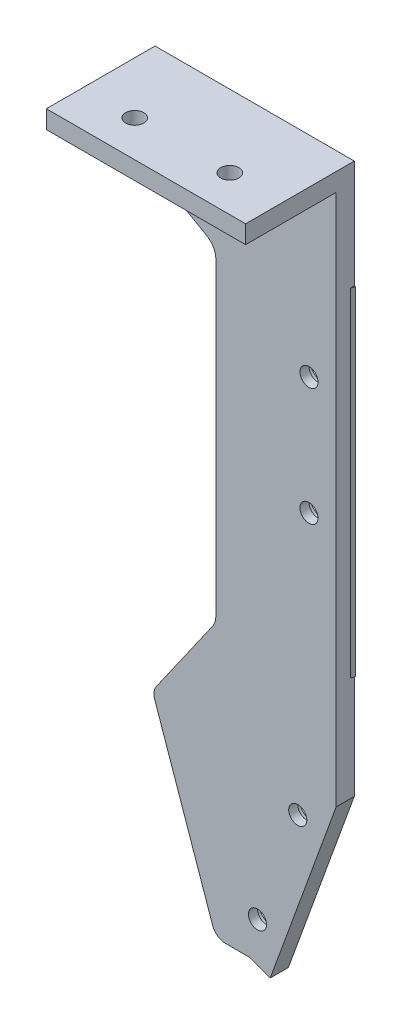
ISO-10303-21;
HEADER;
FILE_DESCRIPTION(('STEP AP214'),'2;1');
FILE_NAME('part.step','',(''),(''),'','','');
FILE_SCHEMA(('AUTOMOTIVE_DESIGN { 1 0 10303 214 1 1 1 1 }'));
ENDSEC;
DATA;
#1=APPLICATION_CONTEXT('core data for automotive mechanical design processes');
#2=APPLICATION_PROTOCOL_DEFINITION('international standard','automotive_design',2000,#1);
#3=PRODUCT_CONTEXT('',#1,'mechanical');
#4=PRODUCT('Part','Part','',(#3));
#5=PRODUCT_RELATED_PRODUCT_CATEGORY('part','',(#4));
#6=PRODUCT_DEFINITION_FORMATION('','',#4);
#7=PRODUCT_DEFINITION_CONTEXT('part definition',#1,'design');
#8=PRODUCT_DEFINITION('design','',#6,#7);
#9=PRODUCT_DEFINITION_SHAPE('','',#8);
#10=(LENGTH_UNIT() NAMED_UNIT(*) SI_UNIT(.MILLI.,.METRE.));
#11=(NAMED_UNIT(*) PLANE_ANGLE_UNIT() SI_UNIT($,.RADIAN.));
#12=(NAMED_UNIT(*) SI_UNIT($,.STERADIAN.) SOLID_ANGLE_UNIT());
#13=UNCERTAINTY_MEASURE_WITH_UNIT(LENGTH_MEASURE(1.E-05),#10,'distance_accuracy_value','');
#14=(GEOMETRIC_REPRESENTATION_CONTEXT(3) GLOBAL_UNCERTAINTY_ASSIGNED_CONTEXT((#13)) GLOBAL_UNIT_ASSIGNED_CONTEXT((#10,
#11,#12)) REPRESENTATION_CONTEXT('',''));
#15=CARTESIAN_POINT('',(0.,0.,0.));
#16=DIRECTION('',(0.,0.,1.));
#17=DIRECTION('',(1.,0.,0.));
#18=AXIS2_PLACEMENT_3D('',#15,#16,#17);
#19=CARTESIAN_POINT('',(92.2895532458189,-51.5135083268963,13.5));
#20=DIRECTION('',(0.,0.,1.));
#21=DIRECTION('',(1.,0.,0.));
#22=AXIS2_PLACEMENT_3D('',#19,#20,#21);
#23=CYLINDRICAL_SURFACE('',#22,0.999999999999998);
#24=CARTESIAN_POINT('',(92.2895532458189,-51.5135083268963,23.5));
#25=DIRECTION('',(0.,0.,1.));
#26=DIRECTION('',(1.,0.,0.));
#27=AXIS2_PLACEMENT_3D('',#24,#25,#26);
#28=CIRCLE('',#27,0.999999999999998);
#29=CARTESIAN_POINT('',(93.2895532458189,-51.5135083268963,23.5));
#30=VERTEX_POINT('',#29);
#31=EDGE_CURVE('E360',#30,#30,#28,.T.);
#32=ORIENTED_EDGE('',*,*,#31,.T.);
#33=EDGE_LOOP('',(#32));
#34=FACE_BOUND('',#33,.T.);
#35=CARTESIAN_POINT('',(92.2895532458189,-51.5135083268963,22.5));
#36=DIRECTION('',(0.,0.,-1.));
#37=DIRECTION('',(-1.,0.,0.));
#38=AXIS2_PLACEMENT_3D('',#35,#36,#37);
#39=CIRCLE('',#38,0.999999999999998);
#40=CARTESIAN_POINT('',(91.2895532458189,-51.5135083268963,22.5));
#41=VERTEX_POINT('',#40);
#42=EDGE_CURVE('E40',#41,#41,#39,.F.);
#43=ORIENTED_EDGE('',*,*,#42,.F.);
#44=EDGE_LOOP('',(#43));
#45=FACE_BOUND('',#44,.T.);
#46=ADVANCED_FACE('F36',(#34,#45),#23,.F.);
#47=CARTESIAN_POINT('',(91.0464555518717,-94.0197311334143,13.5));
#48=DIRECTION('',(0.,0.,1.));
#49=DIRECTION('',(1.,0.,0.));
#50=AXIS2_PLACEMENT_3D('',#47,#48,#49);
#51=CYLINDRICAL_SURFACE('',#50,0.999999999999998);
#52=CARTESIAN_POINT('',(91.0464555518717,-94.0197311334143,23.5));
#53=DIRECTION('',(0.,0.,1.));
#54=DIRECTION('',(1.,0.,0.));
#55=AXIS2_PLACEMENT_3D('',#52,#53,#54);
#56=CIRCLE('',#55,0.999999999999998);
#57=CARTESIAN_POINT('',(92.0464555518717,-94.0197311334143,23.5));
#58=VERTEX_POINT('',#57);
#59=EDGE_CURVE('E336',#58,#58,#56,.T.);
#60=ORIENTED_EDGE('',*,*,#59,.T.);
#61=EDGE_LOOP('',(#60));
#62=FACE_BOUND('',#61,.T.);
#63=CARTESIAN_POINT('',(91.0464555518717,-94.0197311334143,22.5));
#64=DIRECTION('',(0.,0.,-1.));
#65=DIRECTION('',(-1.,0.,0.));
#66=AXIS2_PLACEMENT_3D('',#63,#64,#65);
#67=CIRCLE('',#66,0.999999999999998);
#68=CARTESIAN_POINT('',(90.0464555518717,-94.0197311334143,22.5));
#69=VERTEX_POINT('',#68);
#70=EDGE_CURVE('E340',#69,#69,#67,.F.);
#71=ORIENTED_EDGE('',*,*,#70,.F.);
#72=EDGE_LOOP('',(#71));
#73=FACE_BOUND('',#72,.T.);
#74=ADVANCED_FACE('F461',(#62,#73),#51,.F.);
#75=CARTESIAN_POINT('',(92.2895532458189,-64.5135083268963,13.5));
#76=DIRECTION('',(0.,0.,1.));
#77=DIRECTION('',(1.,0.,0.));
#78=AXIS2_PLACEMENT_3D('',#75,#76,#77);
#79=CYLINDRICAL_SURFACE('',#78,0.999999999999998);
#80=CARTESIAN_POINT('',(92.2895532458189,-64.5135083268963,23.5));
#81=DIRECTION('',(0.,0.,1.));
#82=DIRECTION('',(1.,0.,0.));
#83=AXIS2_PLACEMENT_3D('',#80,#81,#82);
#84=CIRCLE('',#83,0.999999999999998);
#85=CARTESIAN_POINT('',(93.2895532458189,-64.5135083268963,23.5));
#86=VERTEX_POINT('',#85);
#87=EDGE_CURVE('E357',#86,#86,#84,.T.);
#88=ORIENTED_EDGE('',*,*,#87,.T.);
#89=EDGE_LOOP('',(#88));
#90=FACE_BOUND('',#89,.T.);
#91=CARTESIAN_POINT('',(92.2895532458189,-64.5135083268963,22.5));
#92=DIRECTION('',(0.,0.,-1.));
#93=DIRECTION('',(-1.,0.,0.));
#94=AXIS2_PLACEMENT_3D('',#91,#92,#93);
#95=CIRCLE('',#94,0.999999999999998);
#96=CARTESIAN_POINT('',(91.2895532458189,-64.5135083268963,22.5));
#97=VERTEX_POINT('',#96);
#98=EDGE_CURVE('E338',#97,#97,#95,.F.);
#99=ORIENTED_EDGE('',*,*,#98,.F.);
#100=EDGE_LOOP('',(#99));
#101=FACE_BOUND('',#100,.T.);
#102=ADVANCED_FACE('F468',(#90,#101),#79,.F.);
#103=CARTESIAN_POINT('',(86.6001936886376,-106.235735203631,13.5));
#104=DIRECTION('',(0.,0.,1.));
#105=DIRECTION('',(1.,0.,0.));
#106=AXIS2_PLACEMENT_3D('',#103,#104,#105);
#107=CYLINDRICAL_SURFACE('',#106,0.999999999999998);
#108=CARTESIAN_POINT('',(86.6001936886376,-106.235735203631,23.5));
#109=DIRECTION('',(0.,0.,1.));
#110=DIRECTION('',(1.,0.,0.));
#111=AXIS2_PLACEMENT_3D('',#108,#109,#110);
#112=CIRCLE('',#111,0.999999999999998);
#113=CARTESIAN_POINT('',(87.6001936886376,-106.235735203631,23.5));
#114=VERTEX_POINT('',#113);
#115=EDGE_CURVE('E361',#114,#114,#112,.T.);
#116=ORIENTED_EDGE('',*,*,#115,.T.);
#117=EDGE_LOOP('',(#116));
#118=FACE_BOUND('',#117,.T.);
#119=CARTESIAN_POINT('',(86.6001936886376,-106.235735203631,22.5));
#120=DIRECTION('',(0.,0.,-1.));
#121=DIRECTION('',(-1.,0.,0.));
#122=AXIS2_PLACEMENT_3D('',#119,#120,#121);
#123=CIRCLE('',#122,0.999999999999998);
#124=CARTESIAN_POINT('',(85.6001936886376,-106.235735203631,22.5));
#125=VERTEX_POINT('',#124);
#126=EDGE_CURVE('E333',#125,#125,#123,.F.);
#127=ORIENTED_EDGE('',*,*,#126,.F.);
#128=EDGE_LOOP('',(#127));
#129=FACE_BOUND('',#128,.T.);
#130=ADVANCED_FACE('F492',(#118,#129),#107,.F.);
#131=CARTESIAN_POINT('',(0.,0.,23.5));
#132=DIRECTION('',(0.,0.,-1.));
#133=DIRECTION('',(-1.,0.,0.));
#134=AXIS2_PLACEMENT_3D('',#131,#132,#133);
#135=PLANE('',#134);
#136=ORIENTED_EDGE('',*,*,#87,.F.);
#137=EDGE_LOOP('',(#136));
#138=FACE_BOUND('',#137,.T.);
#139=ORIENTED_EDGE('',*,*,#115,.F.);
#140=EDGE_LOOP('',(#139));
#141=FACE_BOUND('',#140,.T.);
#142=ORIENTED_EDGE('',*,*,#59,.F.);
#143=EDGE_LOOP('',(#142));
#144=FACE_BOUND('',#143,.T.);
#145=ORIENTED_EDGE('',*,*,#31,.F.);
#146=EDGE_LOOP('',(#145));
#147=FACE_BOUND('',#146,.T.);
#148=DIRECTION('',(1.,0.,0.));
#149=VECTOR('',#148,1.);
#150=CARTESIAN_POINT('',(95.2895532458189,-32.3635083268963,23.5));
#151=LINE('',#150,#149);
#152=CARTESIAN_POINT('',(73.2895532458189,-32.3635083268963,23.5));
#153=VERTEX_POINT('',#152);
#154=CARTESIAN_POINT('',(95.2895532458189,-32.3635083268963,23.5));
#155=VERTEX_POINT('',#154);
#156=EDGE_CURVE('E53',#153,#155,#151,.T.);
#157=ORIENTED_EDGE('',*,*,#156,.F.);
#158=DIRECTION('',(0.,-1.,0.));
#159=VECTOR('',#158,1.);
#160=CARTESIAN_POINT('',(73.2895532458189,0.,23.5));
#161=LINE('',#160,#159);
#162=CARTESIAN_POINT('',(73.2895532458189,-38.0445239136101,23.5));
#163=VERTEX_POINT('',#162);
#164=EDGE_CURVE('E56',#153,#163,#161,.T.);
#165=ORIENTED_EDGE('',*,*,#164,.T.);
#166=CARTESIAN_POINT('',(75.2895532458189,-38.0445239136101,23.5));
#167=DIRECTION('',(0.,0.,-1.));
#168=DIRECTION('',(-1.,0.,0.));
#169=AXIS2_PLACEMENT_3D('',#166,#167,#168);
#170=CIRCLE('',#169,2.);
#171=CARTESIAN_POINT('',(74.2895532458182,-39.7765747211803,23.5));
#172=VERTEX_POINT('',#171);
#173=EDGE_CURVE('E11',#163,#172,#170,.F.);
#174=ORIENTED_EDGE('',*,*,#173,.T.);
#175=DIRECTION('',(-0.866025403784429,0.500000000000017,0.));
#176=VECTOR('',#175,1.);
#177=CARTESIAN_POINT('',(1.34862621941938,2.3358891324538,23.5));
#178=LINE('',#177,#176);
#179=CARTESIAN_POINT('',(81.,-43.65085296109,23.5));
#180=VERTEX_POINT('',#179);
#181=EDGE_CURVE('E236',#180,#172,#178,.T.);
#182=ORIENTED_EDGE('',*,*,#181,.F.);
#183=CARTESIAN_POINT('',(80.,-45.38290376865,23.5));
#184=DIRECTION('',(0.,0.,-1.));
#185=DIRECTION('',(-1.,0.,0.));
#186=AXIS2_PLACEMENT_3D('',#183,#184,#185);
#187=CIRCLE('',#186,2.);
#188=CARTESIAN_POINT('',(82.,-45.38290376865,23.5));
#189=VERTEX_POINT('',#188);
#190=EDGE_CURVE('E233',#189,#180,#187,.F.);
#191=ORIENTED_EDGE('',*,*,#190,.F.);
#192=DIRECTION('',(0.,1.,0.));
#193=VECTOR('',#192,1.);
#194=CARTESIAN_POINT('',(82.,0.,23.5));
#195=LINE('',#194,#193);
#196=CARTESIAN_POINT('',(82.,-79.5316263413399,23.5));
#197=VERTEX_POINT('',#196);
#198=EDGE_CURVE('E230',#197,#189,#195,.T.);
#199=ORIENTED_EDGE('',*,*,#198,.F.);
#200=CARTESIAN_POINT('',(80.,-79.5316263413399,23.5));
#201=DIRECTION('',(0.,0.,-1.));
#202=DIRECTION('',(-1.,0.,0.));
#203=AXIS2_PLACEMENT_3D('',#200,#201,#202);
#204=CIRCLE('',#203,2.);
#205=CARTESIAN_POINT('',(81.6383040885789,-80.6787792140407,23.5));
#206=VERTEX_POINT('',#205);
#207=EDGE_CURVE('E227',#206,#197,#204,.F.);
#208=ORIENTED_EDGE('',*,*,#207,.F.);
#209=DIRECTION('',(0.573576436351011,0.819152044289016,0.));
#210=VECTOR('',#209,1.);
#211=CARTESIAN_POINT('',(92.6867510176329,-64.8999617547072,23.5));
#212=LINE('',#211,#210);
#213=CARTESIAN_POINT('',(75.439940364479,-89.5309600116699,23.5));
#214=VERTEX_POINT('',#213);
#215=EDGE_CURVE('E224',#214,#206,#212,.T.);
#216=ORIENTED_EDGE('',*,*,#215,.F.);
#217=CARTESIAN_POINT('',(76.668668430912,-90.3913246662,23.5));
#218=DIRECTION('',(0.,0.,-1.));
#219=DIRECTION('',(-1.,0.,0.));
#220=AXIS2_PLACEMENT_3D('',#217,#218,#219);
#221=CIRCLE('',#220,1.5);
#222=CARTESIAN_POINT('',(75.2518037731161,-90.8837620139803,23.5));
#223=VERTEX_POINT('',#222);
#224=EDGE_CURVE('E221',#223,#214,#221,.T.);
#225=ORIENTED_EDGE('',*,*,#224,.F.);
#226=DIRECTION('',(-0.328291565188003,0.944576438530208,0.));
#227=VECTOR('',#226,1.);
#228=CARTESIAN_POINT('',(38.9587796924058,13.5402898498463,23.5));
#229=LINE('',#228,#227);
#230=CARTESIAN_POINT('',(81.6498173079181,-109.29243734778,23.5));
#231=VERTEX_POINT('',#230);
#232=EDGE_CURVE('E218',#231,#223,#229,.T.);
#233=ORIENTED_EDGE('',*,*,#232,.F.);
#234=CARTESIAN_POINT('',(83.066681965713,-108.8,23.5));
#235=DIRECTION('',(0.,0.,-1.));
#236=DIRECTION('',(-1.,0.,0.));
#237=AXIS2_PLACEMENT_3D('',#234,#235,#236);
#238=CIRCLE('',#237,1.5);
#239=CARTESIAN_POINT('',(83.066681965713,-110.3,23.5));
#240=VERTEX_POINT('',#239);
#241=EDGE_CURVE('E215',#240,#231,#238,.T.);
#242=ORIENTED_EDGE('',*,*,#241,.F.);
#243=DIRECTION('',(-1.,0.,0.));
#244=VECTOR('',#243,1.);
#245=CARTESIAN_POINT('',(-1.77186336060973E-12,-110.299999999999,23.5));
#246=LINE('',#245,#244);
#247=CARTESIAN_POINT('',(85.720595314676,-110.3,23.5));
#248=VERTEX_POINT('',#247);
#249=EDGE_CURVE('E212',#248,#240,#246,.T.);
#250=ORIENTED_EDGE('',*,*,#249,.F.);
#251=DIRECTION('',(-0.939692620785897,0.342020143325699,0.));
#252=VECTOR('',#251,1.);
#253=CARTESIAN_POINT('',(-25.4223318677038,-69.8472827563908,23.5));
#254=LINE('',#253,#252);
#255=CARTESIAN_POINT('',(88.0101485604946,-111.133329231243,23.5));
#256=VERTEX_POINT('',#255);
#257=EDGE_CURVE('E209',#256,#248,#254,.T.);
#258=ORIENTED_EDGE('',*,*,#257,.F.);
#259=DIRECTION('',(-0.342020143325699,-0.939692620785897,0.));
#260=VECTOR('',#259,1.);
#261=CARTESIAN_POINT('',(113.432480428198,-41.2860464748519,23.5));
#262=LINE('',#261,#260);
#263=CARTESIAN_POINT('',(95.2895532458189,-91.1333292312439,23.5));
#264=VERTEX_POINT('',#263);
#265=EDGE_CURVE('E205',#264,#256,#262,.T.);
#266=ORIENTED_EDGE('',*,*,#265,.F.);
#267=DIRECTION('',(0.,1.,0.));
#268=VECTOR('',#267,1.);
#269=CARTESIAN_POINT('',(95.2895532458189,0.,23.5));
#270=LINE('',#269,#268);
#271=EDGE_CURVE('E203',#264,#155,#270,.T.);
#272=ORIENTED_EDGE('',*,*,#271,.T.);
#273=EDGE_LOOP('',(#157,#165,#174,#182,#191,#199,#208,#216,#225,#233,#242,#250,#258,#266,#272));
#274=FACE_BOUND('',#273,.T.);
#275=ADVANCED_FACE('F401',(#138,#141,#144,#147,#274),#135,.F.);
#276=CARTESIAN_POINT('',(93.5,-42.3,21.));
#277=DIRECTION('',(0.,-1.,0.));
#278=DIRECTION('',(-1.,0.,0.));
#279=AXIS2_PLACEMENT_3D('',#276,#277,#278);
#280=CYLINDRICAL_SURFACE('',#279,2.);
#281=CARTESIAN_POINT('',(93.5,-42.3,21.));
#282=DIRECTION('',(0.,-1.,0.));
#283=DIRECTION('',(1.,0.,0.));
#284=AXIS2_PLACEMENT_3D('',#281,#282,#283);
#285=CIRCLE('',#284,2.);
#286=CARTESIAN_POINT('',(95.4364916731037,-42.3,21.5));
#287=VERTEX_POINT('',#286);
#288=CARTESIAN_POINT('',(95.2895532458189,-42.3,21.8930280960748));
#289=VERTEX_POINT('',#288);
#290=EDGE_CURVE('E321',#287,#289,#285,.T.);
#291=ORIENTED_EDGE('',*,*,#290,.T.);
#292=DIRECTION('',(0.,-1.,0.));
#293=VECTOR('',#292,1.);
#294=CARTESIAN_POINT('',(95.2895532458189,-42.3,21.8930280960748));
#295=LINE('',#294,#293);
#296=CARTESIAN_POINT('',(95.2895532458189,-79.5997924618132,21.8930280960748));
#297=VERTEX_POINT('',#296);
#298=EDGE_CURVE('E251',#289,#297,#295,.T.);
#299=ORIENTED_EDGE('',*,*,#298,.T.);
#300=CARTESIAN_POINT('',(93.5,-79.59979246179,21.));
#301=DIRECTION('',(0.,-1.,0.));
#302=DIRECTION('',(1.,0.,0.));
#303=AXIS2_PLACEMENT_3D('',#300,#301,#302);
#304=CIRCLE('',#303,2.);
#305=CARTESIAN_POINT('',(95.4364916731037,-79.5997924618132,21.5));
#306=VERTEX_POINT('',#305);
#307=EDGE_CURVE('E272',#306,#297,#304,.T.);
#308=ORIENTED_EDGE('',*,*,#307,.F.);
#309=DIRECTION('',(0.,-1.,0.));
#310=VECTOR('',#309,1.);
#311=CARTESIAN_POINT('',(95.4364916731037,-42.3,21.5));
#312=LINE('',#311,#310);
#313=EDGE_CURVE('E263',#287,#306,#312,.T.);
#314=ORIENTED_EDGE('',*,*,#313,.F.);
#315=EDGE_LOOP('',(#291,#299,#308,#314));
#316=FACE_BOUND('',#315,.T.);
#317=ADVANCED_FACE('F446',(#316),#280,.T.);
#318=CARTESIAN_POINT('',(94.38388347648,-79.59979246179,21.88388347648));
#319=DIRECTION('',(0.,1.,0.));
#320=DIRECTION('',(0.,0.,-1.));
#321=AXIS2_PLACEMENT_3D('',#318,#319,#320);
#322=PLANE('',#321);
#323=DIRECTION('',(0.,0.,1.));
#324=VECTOR('',#323,1.);
#325=CARTESIAN_POINT('',(95.2895532458189,-79.59979246179,21.88388347648));
#326=LINE('',#325,#324);
#327=CARTESIAN_POINT('',(95.2895532458189,-79.5997924618016,21.5));
#328=VERTEX_POINT('',#327);
#329=EDGE_CURVE('E254',#328,#297,#326,.T.);
#330=ORIENTED_EDGE('',*,*,#329,.F.);
#331=DIRECTION('',(1.,0.,0.));
#332=VECTOR('',#331,1.);
#333=CARTESIAN_POINT('',(94.38388347648,-79.59979246179,21.5));
#334=LINE('',#333,#332);
#335=EDGE_CURVE('E266',#328,#306,#334,.T.);
#336=ORIENTED_EDGE('',*,*,#335,.T.);
#337=ORIENTED_EDGE('',*,*,#307,.T.);
#338=EDGE_LOOP('',(#330,#336,#337));
#339=FACE_BOUND('',#338,.T.);
#340=ADVANCED_FACE('F440',(#339),#322,.F.);
#341=CARTESIAN_POINT('',(94.75,-42.3,18.));
#342=DIRECTION('',(0.,1.,0.));
#343=DIRECTION('',(0.,0.,-1.));
#344=AXIS2_PLACEMENT_3D('',#341,#342,#343);
#345=PLANE('',#344);
#346=DIRECTION('',(1.,0.,0.));
#347=VECTOR('',#346,1.);
#348=CARTESIAN_POINT('',(94.75,-42.3,21.5));
#349=LINE('',#348,#347);
#350=CARTESIAN_POINT('',(95.2895532458189,-42.3,21.5));
#351=VERTEX_POINT('',#350);
#352=EDGE_CURVE('E261',#351,#287,#349,.T.);
#353=ORIENTED_EDGE('',*,*,#352,.F.);
#354=DIRECTION('',(0.,0.,1.));
#355=VECTOR('',#354,1.);
#356=CARTESIAN_POINT('',(95.2895532458189,-42.3,18.));
#357=LINE('',#356,#355);
#358=EDGE_CURVE('E244',#351,#289,#357,.T.);
#359=ORIENTED_EDGE('',*,*,#358,.T.);
#360=ORIENTED_EDGE('',*,*,#290,.F.);
#361=EDGE_LOOP('',(#353,#359,#360));
#362=FACE_BOUND('',#361,.T.);
#363=ADVANCED_FACE('F448',(#362),#345,.T.);
#364=CARTESIAN_POINT('',(70.,-110.3,21.5));
#365=DIRECTION('',(0.,0.,1.));
#366=DIRECTION('',(0.,-1.,0.));
#367=AXIS2_PLACEMENT_3D('',#364,#365,#366);
#368=PLANE('',#367);
#369=CARTESIAN_POINT('',(91.0464555518717,-94.0197311334143,21.5));
#370=DIRECTION('',(0.,0.,-1.));
#371=DIRECTION('',(-1.,0.,0.));
#372=AXIS2_PLACEMENT_3D('',#369,#370,#371);
#373=CIRCLE('',#372,2.);
#374=CARTESIAN_POINT('',(89.0464555518717,-94.0197311334143,21.5));
#375=VERTEX_POINT('',#374);
#376=EDGE_CURVE('E810',#375,#375,#373,.T.);
#377=ORIENTED_EDGE('',*,*,#376,.F.);
#378=EDGE_LOOP('',(#377));
#379=FACE_BOUND('',#378,.T.);
#380=CARTESIAN_POINT('',(92.2895532458189,-64.5135083268963,21.5));
#381=DIRECTION('',(0.,0.,-1.));
#382=DIRECTION('',(-1.,0.,0.));
#383=AXIS2_PLACEMENT_3D('',#380,#381,#382);
#384=CIRCLE('',#383,2.);
#385=CARTESIAN_POINT('',(90.2895532458189,-64.5135083268963,21.5));
#386=VERTEX_POINT('',#385);
#387=EDGE_CURVE('E802',#386,#386,#384,.T.);
#388=ORIENTED_EDGE('',*,*,#387,.F.);
#389=EDGE_LOOP('',(#388));
#390=FACE_BOUND('',#389,.T.);
#391=CARTESIAN_POINT('',(92.2895532458189,-51.5135083268963,21.5));
#392=DIRECTION('',(0.,0.,-1.));
#393=DIRECTION('',(-1.,0.,0.));
#394=AXIS2_PLACEMENT_3D('',#391,#392,#393);
#395=CIRCLE('',#394,2.);
#396=CARTESIAN_POINT('',(90.2895532458189,-51.5135083268963,21.5));
#397=VERTEX_POINT('',#396);
#398=EDGE_CURVE('E800',#397,#397,#395,.T.);
#399=ORIENTED_EDGE('',*,*,#398,.F.);
#400=EDGE_LOOP('',(#399));
#401=FACE_BOUND('',#400,.T.);
#402=CARTESIAN_POINT('',(86.6001936886376,-106.235735203631,21.5));
#403=DIRECTION('',(0.,0.,-1.));
#404=DIRECTION('',(-1.,0.,0.));
#405=AXIS2_PLACEMENT_3D('',#402,#403,#404);
#406=CIRCLE('',#405,2.);
#407=CARTESIAN_POINT('',(84.6001936886376,-106.235735203631,21.5));
#408=VERTEX_POINT('',#407);
#409=EDGE_CURVE('E346',#408,#408,#406,.T.);
#410=ORIENTED_EDGE('',*,*,#409,.F.);
#411=EDGE_LOOP('',(#410));
#412=FACE_BOUND('',#411,.T.);
#413=DIRECTION('',(-0.866025403784429,0.500000000000017,0.));
#414=VECTOR('',#413,1.);
#415=CARTESIAN_POINT('',(81.,-43.65085296109,21.5));
#416=LINE('',#415,#414);
#417=CARTESIAN_POINT('',(81.,-43.65085296109,21.5));
#418=VERTEX_POINT('',#417);
#419=CARTESIAN_POINT('',(74.2895532458181,-39.7765747211803,21.5));
#420=VERTEX_POINT('',#419);
#421=EDGE_CURVE('E297',#418,#420,#416,.T.);
#422=ORIENTED_EDGE('',*,*,#421,.T.);
#423=CARTESIAN_POINT('',(75.2895532458189,-38.0445239136101,21.5));
#424=DIRECTION('',(0.,0.,1.));
#425=DIRECTION('',(1.,0.,0.));
#426=AXIS2_PLACEMENT_3D('',#423,#424,#425);
#427=CIRCLE('',#426,2.);
#428=CARTESIAN_POINT('',(73.2895532458189,-38.0445239136101,21.5));
#429=VERTEX_POINT('',#428);
#430=EDGE_CURVE('E330',#420,#429,#427,.F.);
#431=ORIENTED_EDGE('',*,*,#430,.T.);
#432=DIRECTION('',(0.,-1.,0.));
#433=VECTOR('',#432,1.);
#434=CARTESIAN_POINT('',(73.2895532458189,0.,21.5));
#435=LINE('',#434,#433);
#436=CARTESIAN_POINT('',(73.2895532458189,-30.3635083268963,21.5));
#437=VERTEX_POINT('',#436);
#438=EDGE_CURVE('E194',#437,#429,#435,.T.);
#439=ORIENTED_EDGE('',*,*,#438,.F.);
#440=DIRECTION('',(-1.,0.,0.));
#441=VECTOR('',#440,1.);
#442=CARTESIAN_POINT('',(70.,-30.3635083268963,21.5));
#443=LINE('',#442,#441);
#444=CARTESIAN_POINT('',(95.2895532458189,-30.3635083268963,21.5));
#445=VERTEX_POINT('',#444);
#446=EDGE_CURVE('E259',#437,#445,#443,.F.);
#447=ORIENTED_EDGE('',*,*,#446,.T.);
#448=DIRECTION('',(0.,1.,0.));
#449=VECTOR('',#448,1.);
#450=CARTESIAN_POINT('',(95.2895532458189,0.,21.5));
#451=LINE('',#450,#449);
#452=EDGE_CURVE('E202',#351,#445,#451,.T.);
#453=ORIENTED_EDGE('',*,*,#452,.F.);
#454=ORIENTED_EDGE('',*,*,#352,.T.);
#455=ORIENTED_EDGE('',*,*,#313,.T.);
#456=ORIENTED_EDGE('',*,*,#335,.F.);
#457=CARTESIAN_POINT('',(95.2895532458189,-91.1333292312439,21.5));
#458=VERTEX_POINT('',#457);
#459=EDGE_CURVE('E206',#458,#328,#451,.T.);
#460=ORIENTED_EDGE('',*,*,#459,.F.);
#461=DIRECTION('',(-0.342020143325699,-0.939692620785897,0.));
#462=VECTOR('',#461,1.);
#463=CARTESIAN_POINT('',(95.2895532458189,-91.1333292312439,21.5));
#464=LINE('',#463,#462);
#465=CARTESIAN_POINT('',(88.0101485604946,-111.133329231243,21.5));
#466=VERTEX_POINT('',#465);
#467=EDGE_CURVE('E256',#458,#466,#464,.T.);
#468=ORIENTED_EDGE('',*,*,#467,.T.);
#469=DIRECTION('',(-0.939692620785897,0.342020143325699,0.));
#470=VECTOR('',#469,1.);
#471=CARTESIAN_POINT('',(86.190441625069,-110.47101007166,21.5));
#472=LINE('',#471,#470);
#473=CARTESIAN_POINT('',(85.720595314676,-110.3,21.5));
#474=VERTEX_POINT('',#473);
#475=EDGE_CURVE('E269',#466,#474,#472,.T.);
#476=ORIENTED_EDGE('',*,*,#475,.T.);
#477=DIRECTION('',(1.,0.,0.));
#478=VECTOR('',#477,1.);
#479=CARTESIAN_POINT('',(83.066681965713,-110.3,21.5));
#480=LINE('',#479,#478);
#481=CARTESIAN_POINT('',(83.066681965713,-110.3,21.5));
#482=VERTEX_POINT('',#481);
#483=EDGE_CURVE('E274',#482,#474,#480,.T.);
#484=ORIENTED_EDGE('',*,*,#483,.F.);
#485=CARTESIAN_POINT('',(83.066681965713,-108.8,21.5));
#486=DIRECTION('',(0.,0.,-1.));
#487=DIRECTION('',(0.,-1.,0.));
#488=AXIS2_PLACEMENT_3D('',#485,#486,#487);
#489=CIRCLE('',#488,1.5);
#490=CARTESIAN_POINT('',(81.6498173079181,-109.29243734778,21.5));
#491=VERTEX_POINT('',#490);
#492=EDGE_CURVE('E273',#482,#491,#489,.T.);
#493=ORIENTED_EDGE('',*,*,#492,.T.);
#494=DIRECTION('',(-0.328291565188003,0.944576438530208,0.));
#495=VECTOR('',#494,1.);
#496=CARTESIAN_POINT('',(81.6498173079181,-109.29243734778,21.5));
#497=LINE('',#496,#495);
#498=CARTESIAN_POINT('',(75.251803773117,-90.88376201398,21.5));
#499=VERTEX_POINT('',#498);
#500=EDGE_CURVE('E279',#491,#499,#497,.T.);
#501=ORIENTED_EDGE('',*,*,#500,.T.);
#502=CARTESIAN_POINT('',(76.668668430912,-90.3913246662,21.5));
#503=DIRECTION('',(0.,0.,-1.));
#504=DIRECTION('',(-0.944576438530206,-0.328291565188007,0.));
#505=AXIS2_PLACEMENT_3D('',#502,#503,#504);
#506=CIRCLE('',#505,1.5);
#507=CARTESIAN_POINT('',(75.439940364479,-89.5309600116699,21.5));
#508=VERTEX_POINT('',#507);
#509=EDGE_CURVE('E282',#499,#508,#506,.T.);
#510=ORIENTED_EDGE('',*,*,#509,.T.);
#511=DIRECTION('',(0.573576436351011,0.819152044289016,0.));
#512=VECTOR('',#511,1.);
#513=CARTESIAN_POINT('',(75.439940364479,-89.5309600116699,21.5));
#514=LINE('',#513,#512);
#515=CARTESIAN_POINT('',(81.638304088578,-80.67877921404,21.5));
#516=VERTEX_POINT('',#515);
#517=EDGE_CURVE('E285',#508,#516,#514,.T.);
#518=ORIENTED_EDGE('',*,*,#517,.T.);
#519=CARTESIAN_POINT('',(80.,-79.5316263413399,21.5));
#520=DIRECTION('',(0.,0.,1.));
#521=DIRECTION('',(0.81915204428897,-0.573576436351077,0.));
#522=AXIS2_PLACEMENT_3D('',#519,#520,#521);
#523=CIRCLE('',#522,2.);
#524=CARTESIAN_POINT('',(82.,-79.5316263413399,21.5));
#525=VERTEX_POINT('',#524);
#526=EDGE_CURVE('E288',#516,#525,#523,.T.);
#527=ORIENTED_EDGE('',*,*,#526,.T.);
#528=DIRECTION('',(0.,1.,0.));
#529=VECTOR('',#528,1.);
#530=CARTESIAN_POINT('',(82.,-79.5316263413399,21.5));
#531=LINE('',#530,#529);
#532=CARTESIAN_POINT('',(82.,-45.38290376865,21.5));
#533=VERTEX_POINT('',#532);
#534=EDGE_CURVE('E291',#525,#533,#531,.T.);
#535=ORIENTED_EDGE('',*,*,#534,.T.);
#536=CARTESIAN_POINT('',(80.,-45.38290376865,21.5));
#537=DIRECTION('',(0.,0.,1.));
#538=DIRECTION('',(1.,0.,0.));
#539=AXIS2_PLACEMENT_3D('',#536,#537,#538);
#540=CIRCLE('',#539,2.);
#541=EDGE_CURVE('E294',#533,#418,#540,.T.);
#542=ORIENTED_EDGE('',*,*,#541,.T.);
#543=EDGE_LOOP('',(#422,#431,#439,#447,#453,#454,#455,#456,#460,#468,#476,#484,#493,#501,#510,
#518,#527,#535,#542));
#544=FACE_BOUND('',#543,.T.);
#545=ADVANCED_FACE('F392',(#379,#390,#401,#412,#544),#368,.F.);
#546=CARTESIAN_POINT('',(76.,-40.76410161514,22.25));
#547=DIRECTION('',(0.500000000000017,0.866025403784429,0.));
#548=DIRECTION('',(0.866025403784429,-0.500000000000017,0.));
#549=AXIS2_PLACEMENT_3D('',#546,#547,#548);
#550=PLANE('',#549);
#551=ORIENTED_EDGE('',*,*,#181,.T.);
#552=DIRECTION('',(0.,0.,-1.));
#553=VECTOR('',#552,1.);
#554=CARTESIAN_POINT('',(74.2895532458189,-39.776574721179,22.25));
#555=LINE('',#554,#553);
#556=EDGE_CURVE('E327',#172,#420,#555,.T.);
#557=ORIENTED_EDGE('',*,*,#556,.T.);
#558=ORIENTED_EDGE('',*,*,#421,.F.);
#559=DIRECTION('',(0.,0.,-1.));
#560=VECTOR('',#559,1.);
#561=CARTESIAN_POINT('',(81.,-43.65085296109,23.));
#562=LINE('',#561,#560);
#563=EDGE_CURVE('E300',#180,#418,#562,.T.);
#564=ORIENTED_EDGE('',*,*,#563,.F.);
#565=EDGE_LOOP('',(#551,#557,#558,#564));
#566=FACE_BOUND('',#565,.T.);
#567=ADVANCED_FACE('F398',(#566),#550,.F.);
#568=CARTESIAN_POINT('',(80.,-45.38290376865,69.9296));
#569=DIRECTION('',(0.,0.,-1.));
#570=DIRECTION('',(-0.500000000000015,-0.86602540378443,0.));
#571=AXIS2_PLACEMENT_3D('',#568,#569,#570);
#572=CYLINDRICAL_SURFACE('',#571,2.);
#573=ORIENTED_EDGE('',*,*,#541,.F.);
#574=DIRECTION('',(0.,0.,-1.));
#575=VECTOR('',#574,1.);
#576=CARTESIAN_POINT('',(82.,-45.38290376865,23.));
#577=LINE('',#576,#575);
#578=EDGE_CURVE('E303',#189,#533,#577,.T.);
#579=ORIENTED_EDGE('',*,*,#578,.F.);
#580=ORIENTED_EDGE('',*,*,#190,.T.);
#581=ORIENTED_EDGE('',*,*,#563,.T.);
#582=EDGE_LOOP('',(#573,#579,#580,#581));
#583=FACE_BOUND('',#582,.T.);
#584=ADVANCED_FACE('F404',(#583),#572,.F.);
#585=CARTESIAN_POINT('',(82.,-62.19521357469,22.25));
#586=DIRECTION('',(1.,0.,0.));
#587=DIRECTION('',(0.,-1.,0.));
#588=AXIS2_PLACEMENT_3D('',#585,#586,#587);
#589=PLANE('',#588);
#590=DIRECTION('',(0.,0.,-1.));
#591=VECTOR('',#590,1.);
#592=CARTESIAN_POINT('',(82.,-79.5316263413399,23.));
#593=LINE('',#592,#591);
#594=EDGE_CURVE('E306',#197,#525,#593,.T.);
#595=ORIENTED_EDGE('',*,*,#594,.F.);
#596=ORIENTED_EDGE('',*,*,#198,.T.);
#597=ORIENTED_EDGE('',*,*,#578,.T.);
#598=ORIENTED_EDGE('',*,*,#534,.F.);
#599=EDGE_LOOP('',(#595,#596,#597,#598));
#600=FACE_BOUND('',#599,.T.);
#601=ADVANCED_FACE('F406',(#600),#589,.F.);
#602=CARTESIAN_POINT('',(80.,-79.5316263413399,69.9296));
#603=DIRECTION('',(0.,0.,-1.));
#604=DIRECTION('',(-1.,0.,0.));
#605=AXIS2_PLACEMENT_3D('',#602,#603,#604);
#606=CYLINDRICAL_SURFACE('',#605,2.);
#607=ORIENTED_EDGE('',*,*,#526,.F.);
#608=DIRECTION('',(0.,0.,-1.));
#609=VECTOR('',#608,1.);
#610=CARTESIAN_POINT('',(81.638304088578,-80.67877921404,23.));
#611=LINE('',#610,#609);
#612=EDGE_CURVE('E310',#206,#516,#611,.T.);
#613=ORIENTED_EDGE('',*,*,#612,.F.);
#614=ORIENTED_EDGE('',*,*,#207,.T.);
#615=ORIENTED_EDGE('',*,*,#594,.T.);
#616=EDGE_LOOP('',(#607,#613,#614,#615));
#617=FACE_BOUND('',#616,.T.);
#618=ADVANCED_FACE('F410',(#617),#606,.F.);
#619=CARTESIAN_POINT('',(76.,-88.7311119595499,22.25));
#620=DIRECTION('',(0.819152044289016,-0.573576436351011,0.));
#621=DIRECTION('',(-0.573576436351011,-0.819152044289016,0.));
#622=AXIS2_PLACEMENT_3D('',#619,#620,#621);
#623=PLANE('',#622);
#624=ORIENTED_EDGE('',*,*,#517,.F.);
#625=DIRECTION('',(0.,0.,1.));
#626=VECTOR('',#625,1.);
#627=CARTESIAN_POINT('',(75.439940364479,-89.5309600116699,21.5));
#628=LINE('',#627,#626);
#629=EDGE_CURVE('E309',#508,#214,#628,.T.);
#630=ORIENTED_EDGE('',*,*,#629,.T.);
#631=ORIENTED_EDGE('',*,*,#215,.T.);
#632=ORIENTED_EDGE('',*,*,#612,.T.);
#633=EDGE_LOOP('',(#624,#630,#631,#632));
#634=FACE_BOUND('',#633,.T.);
#635=ADVANCED_FACE('F412',(#634),#623,.F.);
#636=CARTESIAN_POINT('',(76.668668430912,-90.3913246662,-59.9296));
#637=DIRECTION('',(0.,0.,1.));
#638=DIRECTION('',(0.819152044289016,-0.573576436351012,0.));
#639=AXIS2_PLACEMENT_3D('',#636,#637,#638);
#640=CYLINDRICAL_SURFACE('',#639,1.5);
#641=ORIENTED_EDGE('',*,*,#629,.F.);
#642=ORIENTED_EDGE('',*,*,#509,.F.);
#643=DIRECTION('',(0.,0.,1.));
#644=VECTOR('',#643,1.);
#645=CARTESIAN_POINT('',(75.251803773117,-90.88376201398,21.5));
#646=LINE('',#645,#644);
#647=EDGE_CURVE('E313',#499,#223,#646,.T.);
#648=ORIENTED_EDGE('',*,*,#647,.T.);
#649=ORIENTED_EDGE('',*,*,#224,.T.);
#650=EDGE_LOOP('',(#641,#642,#648,#649));
#651=FACE_BOUND('',#650,.T.);
#652=ADVANCED_FACE('F417',(#651),#640,.T.);
#653=CARTESIAN_POINT('',(78.5,-100.22962998314,22.25));
#654=DIRECTION('',(0.944576438530208,0.328291565188003,0.));
#655=DIRECTION('',(0.328291565188003,-0.944576438530208,0.));
#656=AXIS2_PLACEMENT_3D('',#653,#654,#655);
#657=PLANE('',#656);
#658=ORIENTED_EDGE('',*,*,#500,.F.);
#659=DIRECTION('',(0.,0.,1.));
#660=VECTOR('',#659,1.);
#661=CARTESIAN_POINT('',(81.6498173079181,-109.29243734778,21.5));
#662=LINE('',#661,#660);
#663=EDGE_CURVE('E316',#491,#231,#662,.T.);
#664=ORIENTED_EDGE('',*,*,#663,.T.);
#665=ORIENTED_EDGE('',*,*,#232,.T.);
#666=ORIENTED_EDGE('',*,*,#647,.F.);
#667=EDGE_LOOP('',(#658,#664,#665,#666));
#668=FACE_BOUND('',#667,.T.);
#669=ADVANCED_FACE('F420',(#668),#657,.F.);
#670=CARTESIAN_POINT('',(83.066681965713,-108.8,-59.9296));
#671=DIRECTION('',(0.,0.,1.));
#672=DIRECTION('',(0.944576438530206,0.328291565188007,0.));
#673=AXIS2_PLACEMENT_3D('',#670,#671,#672);
#674=CYLINDRICAL_SURFACE('',#673,1.5);
#675=ORIENTED_EDGE('',*,*,#663,.F.);
#676=ORIENTED_EDGE('',*,*,#492,.F.);
#677=DIRECTION('',(0.,0.,1.));
#678=VECTOR('',#677,1.);
#679=CARTESIAN_POINT('',(83.066681965713,-110.3,21.5));
#680=LINE('',#679,#678);
#681=EDGE_CURVE('E276',#482,#240,#680,.T.);
#682=ORIENTED_EDGE('',*,*,#681,.T.);
#683=ORIENTED_EDGE('',*,*,#241,.T.);
#684=EDGE_LOOP('',(#675,#676,#682,#683));
#685=FACE_BOUND('',#684,.T.);
#686=ADVANCED_FACE('F425',(#685),#674,.T.);
#687=CARTESIAN_POINT('',(81.5,-110.3,22.25));
#688=DIRECTION('',(0.,-1.,0.));
#689=DIRECTION('',(-1.,0.,0.));
#690=AXIS2_PLACEMENT_3D('',#687,#688,#689);
#691=PLANE('',#690);
#692=ORIENTED_EDGE('',*,*,#483,.T.);
#693=DIRECTION('',(0.,0.,-1.));
#694=VECTOR('',#693,1.);
#695=CARTESIAN_POINT('',(85.720595314676,-110.3,23.));
#696=LINE('',#695,#694);
#697=EDGE_CURVE('E268',#248,#474,#696,.T.);
#698=ORIENTED_EDGE('',*,*,#697,.F.);
#699=ORIENTED_EDGE('',*,*,#249,.T.);
#700=ORIENTED_EDGE('',*,*,#681,.F.);
#701=EDGE_LOOP('',(#692,#698,#699,#700));
#702=FACE_BOUND('',#701,.T.);
#703=ADVANCED_FACE('F429',(#702),#691,.T.);
#704=CARTESIAN_POINT('',(86.190441625069,-110.47101007166,22.25));
#705=DIRECTION('',(-0.342020143325699,-0.939692620785897,0.));
#706=DIRECTION('',(-0.939692620785897,0.342020143325699,0.));
#707=AXIS2_PLACEMENT_3D('',#704,#705,#706);
#708=PLANE('',#707);
#709=ORIENTED_EDGE('',*,*,#475,.F.);
#710=DIRECTION('',(0.,0.,-1.));
#711=VECTOR('',#710,1.);
#712=CARTESIAN_POINT('',(88.0101485604946,-111.133329231243,23.5));
#713=LINE('',#712,#711);
#714=EDGE_CURVE('E245',#256,#466,#713,.T.);
#715=ORIENTED_EDGE('',*,*,#714,.F.);
#716=ORIENTED_EDGE('',*,*,#257,.T.);
#717=ORIENTED_EDGE('',*,*,#697,.T.);
#718=EDGE_LOOP('',(#709,#715,#716,#717));
#719=FACE_BOUND('',#718,.T.);
#720=ADVANCED_FACE('F433',(#719),#708,.T.);
#721=CARTESIAN_POINT('',(95.2895532458189,0.,23.5));
#722=DIRECTION('',(-1.,0.,0.));
#723=DIRECTION('',(0.,0.,1.));
#724=AXIS2_PLACEMENT_3D('',#721,#722,#723);
#725=PLANE('',#724);
#726=ORIENTED_EDGE('',*,*,#459,.T.);
#727=ORIENTED_EDGE('',*,*,#329,.T.);
#728=ORIENTED_EDGE('',*,*,#298,.F.);
#729=ORIENTED_EDGE('',*,*,#358,.F.);
#730=ORIENTED_EDGE('',*,*,#452,.T.);
#731=DIRECTION('',(0.,0.,-1.));
#732=VECTOR('',#731,1.);
#733=CARTESIAN_POINT('',(95.2895532458189,-30.3635083268963,23.5));
#734=LINE('',#733,#732);
#735=CARTESIAN_POINT('',(95.2895532458189,-30.3635083268963,33.5));
#736=VERTEX_POINT('',#735);
#737=EDGE_CURVE('E241',#736,#445,#734,.T.);
#738=ORIENTED_EDGE('',*,*,#737,.F.);
#739=DIRECTION('',(0.,1.,0.));
#740=VECTOR('',#739,1.);
#741=CARTESIAN_POINT('',(95.2895532458189,-30.3635083268963,33.5));
#742=LINE('',#741,#740);
#743=CARTESIAN_POINT('',(95.2895532458189,-32.3635083268963,33.5));
#744=VERTEX_POINT('',#743);
#745=EDGE_CURVE('E182',#744,#736,#742,.T.);
#746=ORIENTED_EDGE('',*,*,#745,.F.);
#747=DIRECTION('',(0.,0.,-1.));
#748=VECTOR('',#747,1.);
#749=CARTESIAN_POINT('',(95.2895532458189,-32.3635083268963,33.5));
#750=LINE('',#749,#748);
#751=EDGE_CURVE('E178',#744,#155,#750,.T.);
#752=ORIENTED_EDGE('',*,*,#751,.T.);
#753=ORIENTED_EDGE('',*,*,#271,.F.);
#754=DIRECTION('',(0.,0.,-1.));
#755=VECTOR('',#754,1.);
#756=CARTESIAN_POINT('',(95.2895532458189,-91.1333292312439,23.5));
#757=LINE('',#756,#755);
#758=EDGE_CURVE('E239',#264,#458,#757,.T.);
#759=ORIENTED_EDGE('',*,*,#758,.T.);
#760=EDGE_LOOP('',(#726,#727,#728,#729,#730,#738,#746,#752,#753,#759));
#761=FACE_BOUND('',#760,.T.);
#762=ADVANCED_FACE('F383',(#761),#725,.F.);
#763=CARTESIAN_POINT('',(0.,-30.3635083268963,23.5));
#764=DIRECTION('',(0.,1.,0.));
#765=DIRECTION('',(0.,0.,1.));
#766=AXIS2_PLACEMENT_3D('',#763,#764,#765);
#767=PLANE('',#766);
#768=CARTESIAN_POINT('',(79.0395532458189,-30.3635083268963,29.5));
#769=DIRECTION('',(0.,1.,0.));
#770=DIRECTION('',(0.,0.,1.));
#771=AXIS2_PLACEMENT_3D('',#768,#769,#770);
#772=CIRCLE('',#771,0.999999999999998);
#773=CARTESIAN_POINT('',(79.0395532458189,-30.3635083268963,30.5));
#774=VERTEX_POINT('',#773);
#775=EDGE_CURVE('E371',#774,#774,#772,.T.);
#776=ORIENTED_EDGE('',*,*,#775,.F.);
#777=EDGE_LOOP('',(#776));
#778=FACE_BOUND('',#777,.T.);
#779=CARTESIAN_POINT('',(89.5395532458189,-30.3635083268963,29.5));
#780=DIRECTION('',(0.,1.,0.));
#781=DIRECTION('',(0.,0.,1.));
#782=AXIS2_PLACEMENT_3D('',#779,#780,#781);
#783=CIRCLE('',#782,0.999999999999998);
#784=CARTESIAN_POINT('',(89.5395532458189,-30.3635083268963,30.5));
#785=VERTEX_POINT('',#784);
#786=EDGE_CURVE('E377',#785,#785,#783,.T.);
#787=ORIENTED_EDGE('',*,*,#786,.F.);
#788=EDGE_LOOP('',(#787));
#789=FACE_BOUND('',#788,.T.);
#790=DIRECTION('',(0.,0.,-1.));
#791=VECTOR('',#790,1.);
#792=CARTESIAN_POINT('',(73.2895532458189,-30.3635083268963,31.5));
#793=LINE('',#792,#791);
#794=CARTESIAN_POINT('',(73.2895532458189,-30.3635083268963,33.5));
#795=VERTEX_POINT('',#794);
#796=EDGE_CURVE('E196',#795,#437,#793,.T.);
#797=ORIENTED_EDGE('',*,*,#796,.F.);
#798=DIRECTION('',(-1.,0.,0.));
#799=VECTOR('',#798,1.);
#800=CARTESIAN_POINT('',(73.2895532458189,-30.3635083268963,33.5));
#801=LINE('',#800,#799);
#802=EDGE_CURVE('E189',#736,#795,#801,.T.);
#803=ORIENTED_EDGE('',*,*,#802,.F.);
#804=ORIENTED_EDGE('',*,*,#737,.T.);
#805=ORIENTED_EDGE('',*,*,#446,.F.);
#806=EDGE_LOOP('',(#797,#803,#804,#805));
#807=FACE_BOUND('',#806,.T.);
#808=ADVANCED_FACE('F387',(#778,#789,#807),#767,.T.);
#809=CARTESIAN_POINT('',(113.432480428198,-41.2860464748519,23.5));
#810=DIRECTION('',(0.939692620785897,-0.342020143325699,0.));
#811=DIRECTION('',(0.342020143325699,0.939692620785897,0.));
#812=AXIS2_PLACEMENT_3D('',#809,#810,#811);
#813=PLANE('',#812);
#814=ORIENTED_EDGE('',*,*,#467,.F.);
#815=ORIENTED_EDGE('',*,*,#758,.F.);
#816=ORIENTED_EDGE('',*,*,#265,.T.);
#817=ORIENTED_EDGE('',*,*,#714,.T.);
#818=EDGE_LOOP('',(#814,#815,#816,#817));
#819=FACE_BOUND('',#818,.T.);
#820=ADVANCED_FACE('F435',(#819),#813,.T.);
#821=CARTESIAN_POINT('',(73.2895532458189,0.,31.5));
#822=DIRECTION('',(1.,0.,0.));
#823=DIRECTION('',(0.,0.,-1.));
#824=AXIS2_PLACEMENT_3D('',#821,#822,#823);
#825=PLANE('',#824);
#826=ORIENTED_EDGE('',*,*,#438,.T.);
#827=DIRECTION('',(0.,0.,-1.));
#828=VECTOR('',#827,1.);
#829=CARTESIAN_POINT('',(73.2895532458189,-38.0445239136101,31.5));
#830=LINE('',#829,#828);
#831=EDGE_CURVE('E45',#429,#163,#830,.F.);
#832=ORIENTED_EDGE('',*,*,#831,.T.);
#833=ORIENTED_EDGE('',*,*,#164,.F.);
#834=DIRECTION('',(0.,0.,-1.));
#835=VECTOR('',#834,1.);
#836=CARTESIAN_POINT('',(73.2895532458189,-32.3635083268963,33.5));
#837=LINE('',#836,#835);
#838=CARTESIAN_POINT('',(73.2895532458189,-32.3635083268963,33.5));
#839=VERTEX_POINT('',#838);
#840=EDGE_CURVE('E176',#839,#153,#837,.T.);
#841=ORIENTED_EDGE('',*,*,#840,.F.);
#842=DIRECTION('',(0.,-1.,0.));
#843=VECTOR('',#842,1.);
#844=CARTESIAN_POINT('',(73.2895532458189,-32.3635083268963,33.5));
#845=LINE('',#844,#843);
#846=EDGE_CURVE('E183',#795,#839,#845,.T.);
#847=ORIENTED_EDGE('',*,*,#846,.F.);
#848=ORIENTED_EDGE('',*,*,#796,.T.);
#849=EDGE_LOOP('',(#826,#832,#833,#841,#847,#848));
#850=FACE_BOUND('',#849,.T.);
#851=ADVANCED_FACE('F193',(#850),#825,.F.);
#852=CARTESIAN_POINT('',(75.2895532458189,-38.0445239136101,22.25));
#853=DIRECTION('',(0.,0.,-1.));
#854=DIRECTION('',(-1.,0.,0.));
#855=AXIS2_PLACEMENT_3D('',#852,#853,#854);
#856=CYLINDRICAL_SURFACE('',#855,2.);
#857=ORIENTED_EDGE('',*,*,#173,.F.);
#858=ORIENTED_EDGE('',*,*,#831,.F.);
#859=ORIENTED_EDGE('',*,*,#430,.F.);
#860=ORIENTED_EDGE('',*,*,#556,.F.);
#861=EDGE_LOOP('',(#857,#858,#859,#860));
#862=FACE_BOUND('',#861,.T.);
#863=ADVANCED_FACE('F38',(#862),#856,.T.);
#864=CARTESIAN_POINT('',(95.2895532458189,-32.3635083268963,33.5));
#865=DIRECTION('',(0.,1.,0.));
#866=DIRECTION('',(0.,0.,1.));
#867=AXIS2_PLACEMENT_3D('',#864,#865,#866);
#868=PLANE('',#867);
#869=CARTESIAN_POINT('',(79.0395532458189,-32.3635083268963,29.5));
#870=DIRECTION('',(0.,-1.,0.));
#871=DIRECTION('',(0.,0.,-1.));
#872=AXIS2_PLACEMENT_3D('',#869,#870,#871);
#873=CIRCLE('',#872,0.999999999999998);
#874=CARTESIAN_POINT('',(79.0395532458189,-32.3635083268963,28.5));
#875=VERTEX_POINT('',#874);
#876=EDGE_CURVE('E368',#875,#875,#873,.T.);
#877=ORIENTED_EDGE('',*,*,#876,.F.);
#878=EDGE_LOOP('',(#877));
#879=FACE_BOUND('',#878,.T.);
#880=CARTESIAN_POINT('',(89.5395532458189,-32.3635083268963,29.5));
#881=DIRECTION('',(0.,-1.,0.));
#882=DIRECTION('',(0.,0.,-1.));
#883=AXIS2_PLACEMENT_3D('',#880,#881,#882);
#884=CIRCLE('',#883,0.999999999999998);
#885=CARTESIAN_POINT('',(89.5395532458189,-32.3635083268963,28.5));
#886=VERTEX_POINT('',#885);
#887=EDGE_CURVE('E374',#886,#886,#884,.T.);
#888=ORIENTED_EDGE('',*,*,#887,.F.);
#889=EDGE_LOOP('',(#888));
#890=FACE_BOUND('',#889,.T.);
#891=ORIENTED_EDGE('',*,*,#156,.T.);
#892=ORIENTED_EDGE('',*,*,#751,.F.);
#893=DIRECTION('',(1.,0.,0.));
#894=VECTOR('',#893,1.);
#895=CARTESIAN_POINT('',(95.2895532458189,-32.3635083268963,33.5));
#896=LINE('',#895,#894);
#897=EDGE_CURVE('E172',#839,#744,#896,.T.);
#898=ORIENTED_EDGE('',*,*,#897,.F.);
#899=ORIENTED_EDGE('',*,*,#840,.T.);
#900=EDGE_LOOP('',(#891,#892,#898,#899));
#901=FACE_BOUND('',#900,.T.);
#902=ADVANCED_FACE('F174',(#879,#890,#901),#868,.F.);
#903=CARTESIAN_POINT('',(0.,0.,33.5));
#904=DIRECTION('',(0.,0.,-1.));
#905=DIRECTION('',(-1.,0.,0.));
#906=AXIS2_PLACEMENT_3D('',#903,#904,#905);
#907=PLANE('',#906);
#908=ORIENTED_EDGE('',*,*,#846,.T.);
#909=ORIENTED_EDGE('',*,*,#897,.T.);
#910=ORIENTED_EDGE('',*,*,#745,.T.);
#911=ORIENTED_EDGE('',*,*,#802,.T.);
#912=EDGE_LOOP('',(#908,#909,#910,#911));
#913=FACE_BOUND('',#912,.T.);
#914=ADVANCED_FACE('F187',(#913),#907,.F.);
#915=CARTESIAN_POINT('',(89.5395532458189,-27.1135083268963,29.5));
#916=DIRECTION('',(0.,-1.,0.));
#917=DIRECTION('',(0.,0.,-1.));
#918=AXIS2_PLACEMENT_3D('',#915,#916,#917);
#919=CYLINDRICAL_SURFACE('',#918,0.999999999999998);
#920=ORIENTED_EDGE('',*,*,#786,.T.);
#921=EDGE_LOOP('',(#920));
#922=FACE_BOUND('',#921,.T.);
#923=ORIENTED_EDGE('',*,*,#887,.T.);
#924=EDGE_LOOP('',(#923));
#925=FACE_BOUND('',#924,.T.);
#926=ADVANCED_FACE('F478',(#922,#925),#919,.F.);
#927=CARTESIAN_POINT('',(79.0395532458189,-27.1135083268963,29.5));
#928=DIRECTION('',(0.,-1.,0.));
#929=DIRECTION('',(0.,0.,-1.));
#930=AXIS2_PLACEMENT_3D('',#927,#928,#929);
#931=CYLINDRICAL_SURFACE('',#930,0.999999999999998);
#932=ORIENTED_EDGE('',*,*,#775,.T.);
#933=EDGE_LOOP('',(#932));
#934=FACE_BOUND('',#933,.T.);
#935=ORIENTED_EDGE('',*,*,#876,.T.);
#936=EDGE_LOOP('',(#935));
#937=FACE_BOUND('',#936,.T.);
#938=ADVANCED_FACE('F474',(#934,#937),#931,.F.);
#939=CARTESIAN_POINT('',(86.6001936886376,-106.235735203631,22.5));
#940=DIRECTION('',(0.,0.,-1.));
#941=DIRECTION('',(-1.,0.,0.));
#942=AXIS2_PLACEMENT_3D('',#939,#940,#941);
#943=PLANE('',#942);
#944=CARTESIAN_POINT('',(86.6001936886376,-106.235735203631,22.5));
#945=DIRECTION('',(0.,0.,-1.));
#946=DIRECTION('',(-1.,0.,0.));
#947=AXIS2_PLACEMENT_3D('',#944,#945,#946);
#948=CIRCLE('',#947,2.);
#949=CARTESIAN_POINT('',(84.6001936886376,-106.235735203631,22.5));
#950=VERTEX_POINT('',#949);
#951=EDGE_CURVE('E337',#950,#950,#948,.T.);
#952=ORIENTED_EDGE('',*,*,#951,.T.);
#953=EDGE_LOOP('',(#952));
#954=FACE_BOUND('',#953,.T.);
#955=ORIENTED_EDGE('',*,*,#126,.T.);
#956=EDGE_LOOP('',(#955));
#957=FACE_BOUND('',#956,.T.);
#958=ADVANCED_FACE('F477',(#954,#957),#943,.T.);
#959=CARTESIAN_POINT('',(86.6001936886376,-106.235735203631,22.5));
#960=DIRECTION('',(0.,0.,-1.));
#961=DIRECTION('',(-1.,0.,0.));
#962=AXIS2_PLACEMENT_3D('',#959,#960,#961);
#963=CYLINDRICAL_SURFACE('',#962,2.);
#964=ORIENTED_EDGE('',*,*,#951,.F.);
#965=EDGE_LOOP('',(#964));
#966=FACE_BOUND('',#965,.T.);
#967=ORIENTED_EDGE('',*,*,#409,.T.);
#968=EDGE_LOOP('',(#967));
#969=FACE_BOUND('',#968,.T.);
#970=ADVANCED_FACE('F720',(#966,#969),#963,.F.);
#971=CARTESIAN_POINT('',(92.2895532458189,-64.5135083268963,22.5));
#972=DIRECTION('',(0.,0.,-1.));
#973=DIRECTION('',(-1.,0.,0.));
#974=AXIS2_PLACEMENT_3D('',#971,#972,#973);
#975=PLANE('',#974);
#976=CARTESIAN_POINT('',(92.2895532458189,-64.5135083268963,22.5));
#977=DIRECTION('',(0.,0.,-1.));
#978=DIRECTION('',(-1.,0.,0.));
#979=AXIS2_PLACEMENT_3D('',#976,#977,#978);
#980=CIRCLE('',#979,2.);
#981=CARTESIAN_POINT('',(90.2895532458189,-64.5135083268963,22.5));
#982=VERTEX_POINT('',#981);
#983=EDGE_CURVE('E807',#982,#982,#980,.T.);
#984=ORIENTED_EDGE('',*,*,#983,.T.);
#985=EDGE_LOOP('',(#984));
#986=FACE_BOUND('',#985,.T.);
#987=ORIENTED_EDGE('',*,*,#98,.T.);
#988=EDGE_LOOP('',(#987));
#989=FACE_BOUND('',#988,.T.);
#990=ADVANCED_FACE('F727',(#986,#989),#975,.T.);
#991=CARTESIAN_POINT('',(92.2895532458189,-64.5135083268963,22.5));
#992=DIRECTION('',(0.,0.,-1.));
#993=DIRECTION('',(-1.,0.,0.));
#994=AXIS2_PLACEMENT_3D('',#991,#992,#993);
#995=CYLINDRICAL_SURFACE('',#994,2.);
#996=ORIENTED_EDGE('',*,*,#983,.F.);
#997=EDGE_LOOP('',(#996));
#998=FACE_BOUND('',#997,.T.);
#999=ORIENTED_EDGE('',*,*,#387,.T.);
#1000=EDGE_LOOP('',(#999));
#1001=FACE_BOUND('',#1000,.T.);
#1002=ADVANCED_FACE('F735',(#998,#1001),#995,.F.);
#1003=CARTESIAN_POINT('',(91.0464555518717,-94.0197311334143,22.5));
#1004=DIRECTION('',(0.,0.,-1.));
#1005=DIRECTION('',(-1.,0.,0.));
#1006=AXIS2_PLACEMENT_3D('',#1003,#1004,#1005);
#1007=PLANE('',#1006);
#1008=CARTESIAN_POINT('',(91.0464555518717,-94.0197311334143,22.5));
#1009=DIRECTION('',(0.,0.,-1.));
#1010=DIRECTION('',(-1.,0.,0.));
#1011=AXIS2_PLACEMENT_3D('',#1008,#1009,#1010);
#1012=CIRCLE('',#1011,2.);
#1013=CARTESIAN_POINT('',(89.0464555518717,-94.0197311334143,22.5));
#1014=VERTEX_POINT('',#1013);
#1015=EDGE_CURVE('E341',#1014,#1014,#1012,.T.);
#1016=ORIENTED_EDGE('',*,*,#1015,.T.);
#1017=EDGE_LOOP('',(#1016));
#1018=FACE_BOUND('',#1017,.T.);
#1019=ORIENTED_EDGE('',*,*,#70,.T.);
#1020=EDGE_LOOP('',(#1019));
#1021=FACE_BOUND('',#1020,.T.);
#1022=ADVANCED_FACE('F743',(#1018,#1021),#1007,.T.);
#1023=CARTESIAN_POINT('',(91.0464555518717,-94.0197311334143,22.5));
#1024=DIRECTION('',(0.,0.,-1.));
#1025=DIRECTION('',(-1.,0.,0.));
#1026=AXIS2_PLACEMENT_3D('',#1023,#1024,#1025);
#1027=CYLINDRICAL_SURFACE('',#1026,2.);
#1028=ORIENTED_EDGE('',*,*,#1015,.F.);
#1029=EDGE_LOOP('',(#1028));
#1030=FACE_BOUND('',#1029,.T.);
#1031=ORIENTED_EDGE('',*,*,#376,.T.);
#1032=EDGE_LOOP('',(#1031));
#1033=FACE_BOUND('',#1032,.T.);
#1034=ADVANCED_FACE('F751',(#1030,#1033),#1027,.F.);
#1035=CARTESIAN_POINT('',(92.2895532458189,-51.5135083268963,22.5));
#1036=DIRECTION('',(0.,0.,-1.));
#1037=DIRECTION('',(-1.,0.,0.));
#1038=AXIS2_PLACEMENT_3D('',#1035,#1036,#1037);
#1039=PLANE('',#1038);
#1040=CARTESIAN_POINT('',(92.2895532458189,-51.5135083268963,22.5));
#1041=DIRECTION('',(0.,0.,-1.));
#1042=DIRECTION('',(-1.,0.,0.));
#1043=AXIS2_PLACEMENT_3D('',#1040,#1041,#1042);
#1044=CIRCLE('',#1043,2.);
#1045=CARTESIAN_POINT('',(90.2895532458189,-51.5135083268963,22.5));
#1046=VERTEX_POINT('',#1045);
#1047=EDGE_CURVE('E797',#1046,#1046,#1044,.T.);
#1048=ORIENTED_EDGE('',*,*,#1047,.T.);
#1049=EDGE_LOOP('',(#1048));
#1050=FACE_BOUND('',#1049,.T.);
#1051=ORIENTED_EDGE('',*,*,#42,.T.);
#1052=EDGE_LOOP('',(#1051));
#1053=FACE_BOUND('',#1052,.T.);
#1054=ADVANCED_FACE('F759',(#1050,#1053),#1039,.T.);
#1055=CARTESIAN_POINT('',(92.2895532458189,-51.5135083268963,22.5));
#1056=DIRECTION('',(0.,0.,-1.));
#1057=DIRECTION('',(-1.,0.,0.));
#1058=AXIS2_PLACEMENT_3D('',#1055,#1056,#1057);
#1059=CYLINDRICAL_SURFACE('',#1058,2.);
#1060=ORIENTED_EDGE('',*,*,#1047,.F.);
#1061=EDGE_LOOP('',(#1060));
#1062=FACE_BOUND('',#1061,.T.);
#1063=ORIENTED_EDGE('',*,*,#398,.T.);
#1064=EDGE_LOOP('',(#1063));
#1065=FACE_BOUND('',#1064,.T.);
#1066=ADVANCED_FACE('F767',(#1062,#1065),#1059,.F.);
#1067=CLOSED_SHELL('',(#46,#74,#102,#130,#275,#317,#340,#363,#545,#567,#584,#601,#618,#635,#652,
#669,#686,#703,#720,#762,#808,#820,#851,#863,#902,#914,#926,#938,#958,#970,#990,#1002,#1022,
#1034,#1054,#1066));
#1068=MANIFOLD_SOLID_BREP('B2',#1067);
#1069=ADVANCED_BREP_SHAPE_REPRESENTATION('',(#18,#1068),#14);
#1070=SHAPE_DEFINITION_REPRESENTATION(#9,#1069);
ENDSEC;
END-ISO-10303-21;
